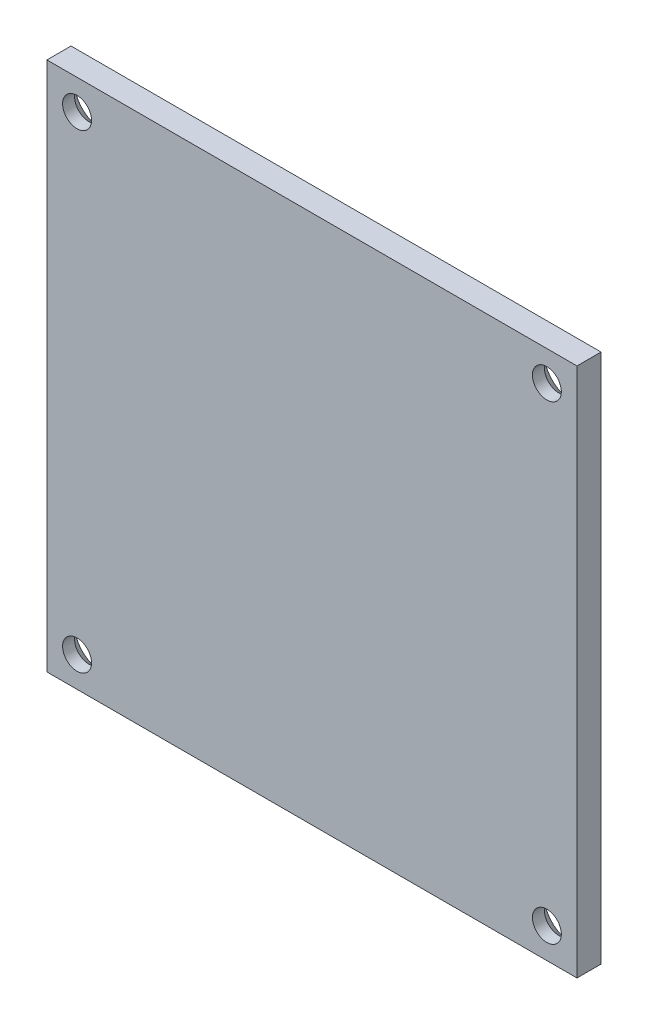
ISO-10303-21;
HEADER;
FILE_DESCRIPTION(('STEP AP214'),'2;1');
FILE_NAME('part.step','',(''),(''),'','','');
FILE_SCHEMA(('AUTOMOTIVE_DESIGN { 1 0 10303 214 1 1 1 1 }'));
ENDSEC;
DATA;
#1=APPLICATION_CONTEXT('core data for automotive mechanical design processes');
#2=APPLICATION_PROTOCOL_DEFINITION('international standard','automotive_design',2000,#1);
#3=PRODUCT_CONTEXT('',#1,'mechanical');
#4=PRODUCT('Part','Part','',(#3));
#5=PRODUCT_RELATED_PRODUCT_CATEGORY('part','',(#4));
#6=PRODUCT_DEFINITION_FORMATION('','',#4);
#7=PRODUCT_DEFINITION_CONTEXT('part definition',#1,'design');
#8=PRODUCT_DEFINITION('design','',#6,#7);
#9=PRODUCT_DEFINITION_SHAPE('','',#8);
#10=(LENGTH_UNIT() NAMED_UNIT(*) SI_UNIT(.MILLI.,.METRE.));
#11=(NAMED_UNIT(*) PLANE_ANGLE_UNIT() SI_UNIT($,.RADIAN.));
#12=(NAMED_UNIT(*) SI_UNIT($,.STERADIAN.) SOLID_ANGLE_UNIT());
#13=UNCERTAINTY_MEASURE_WITH_UNIT(LENGTH_MEASURE(1.E-05),#10,'distance_accuracy_value','');
#14=(GEOMETRIC_REPRESENTATION_CONTEXT(3) GLOBAL_UNCERTAINTY_ASSIGNED_CONTEXT((#13)) GLOBAL_UNIT_ASSIGNED_CONTEXT((#10,
#11,#12)) REPRESENTATION_CONTEXT('',''));
#15=CARTESIAN_POINT('',(0.,0.,0.));
#16=DIRECTION('',(0.,0.,1.));
#17=DIRECTION('',(1.,0.,0.));
#18=AXIS2_PLACEMENT_3D('',#15,#16,#17);
#19=CARTESIAN_POINT('',(22.,22.,2.));
#20=DIRECTION('',(0.,-1.,0.));
#21=DIRECTION('',(0.,0.,-1.));
#22=AXIS2_PLACEMENT_3D('',#19,#20,#21);
#23=PLANE('',#22);
#24=DIRECTION('',(-1.,0.,0.));
#25=VECTOR('',#24,1.);
#26=CARTESIAN_POINT('',(22.,22.,0.));
#27=LINE('',#26,#25);
#28=CARTESIAN_POINT('',(22.,22.,0.));
#29=VERTEX_POINT('',#28);
#30=CARTESIAN_POINT('',(-22.,22.,0.));
#31=VERTEX_POINT('',#30);
#32=EDGE_CURVE('E102',#29,#31,#27,.T.);
#33=ORIENTED_EDGE('',*,*,#32,.T.);
#34=DIRECTION('',(0.,0.,-1.));
#35=VECTOR('',#34,1.);
#36=CARTESIAN_POINT('',(-22.,22.,2.));
#37=LINE('',#36,#35);
#38=CARTESIAN_POINT('',(-22.,22.,2.));
#39=VERTEX_POINT('',#38);
#40=EDGE_CURVE('E11',#39,#31,#37,.T.);
#41=ORIENTED_EDGE('',*,*,#40,.F.);
#42=DIRECTION('',(-1.,0.,0.));
#43=VECTOR('',#42,1.);
#44=CARTESIAN_POINT('',(22.,22.,2.));
#45=LINE('',#44,#43);
#46=CARTESIAN_POINT('',(22.,22.,2.));
#47=VERTEX_POINT('',#46);
#48=EDGE_CURVE('E90',#47,#39,#45,.T.);
#49=ORIENTED_EDGE('',*,*,#48,.F.);
#50=DIRECTION('',(0.,0.,-1.));
#51=VECTOR('',#50,1.);
#52=CARTESIAN_POINT('',(22.,22.,2.));
#53=LINE('',#52,#51);
#54=EDGE_CURVE('E98',#47,#29,#53,.T.);
#55=ORIENTED_EDGE('',*,*,#54,.T.);
#56=EDGE_LOOP('',(#33,#41,#49,#55));
#57=FACE_BOUND('',#56,.T.);
#58=ADVANCED_FACE('F39',(#57),#23,.F.);
#59=CARTESIAN_POINT('',(-22.,-22.,2.));
#60=DIRECTION('',(1.,0.,0.));
#61=DIRECTION('',(0.,0.,-1.));
#62=AXIS2_PLACEMENT_3D('',#59,#60,#61);
#63=PLANE('',#62);
#64=DIRECTION('',(0.,-1.,0.));
#65=VECTOR('',#64,1.);
#66=CARTESIAN_POINT('',(-22.,-22.,0.));
#67=LINE('',#66,#65);
#68=CARTESIAN_POINT('',(-22.,-22.,0.));
#69=VERTEX_POINT('',#68);
#70=EDGE_CURVE('E94',#31,#69,#67,.T.);
#71=ORIENTED_EDGE('',*,*,#70,.T.);
#72=DIRECTION('',(0.,0.,-1.));
#73=VECTOR('',#72,1.);
#74=CARTESIAN_POINT('',(-22.,-22.,2.));
#75=LINE('',#74,#73);
#76=CARTESIAN_POINT('',(-22.,-22.,2.));
#77=VERTEX_POINT('',#76);
#78=EDGE_CURVE('E47',#77,#69,#75,.T.);
#79=ORIENTED_EDGE('',*,*,#78,.F.);
#80=DIRECTION('',(0.,-1.,0.));
#81=VECTOR('',#80,1.);
#82=CARTESIAN_POINT('',(-22.,-22.,2.));
#83=LINE('',#82,#81);
#84=EDGE_CURVE('E85',#39,#77,#83,.T.);
#85=ORIENTED_EDGE('',*,*,#84,.F.);
#86=ORIENTED_EDGE('',*,*,#40,.T.);
#87=EDGE_LOOP('',(#71,#79,#85,#86));
#88=FACE_BOUND('',#87,.T.);
#89=ADVANCED_FACE('F93',(#88),#63,.F.);
#90=CARTESIAN_POINT('',(22.,-22.,2.));
#91=DIRECTION('',(0.,1.,0.));
#92=DIRECTION('',(0.,0.,1.));
#93=AXIS2_PLACEMENT_3D('',#90,#91,#92);
#94=PLANE('',#93);
#95=DIRECTION('',(1.,0.,0.));
#96=VECTOR('',#95,1.);
#97=CARTESIAN_POINT('',(22.,-22.,0.));
#98=LINE('',#97,#96);
#99=CARTESIAN_POINT('',(22.,-22.,0.));
#100=VERTEX_POINT('',#99);
#101=EDGE_CURVE('E72',#69,#100,#98,.T.);
#102=ORIENTED_EDGE('',*,*,#101,.T.);
#103=DIRECTION('',(0.,0.,-1.));
#104=VECTOR('',#103,1.);
#105=CARTESIAN_POINT('',(22.,-22.,2.));
#106=LINE('',#105,#104);
#107=CARTESIAN_POINT('',(22.,-22.,2.));
#108=VERTEX_POINT('',#107);
#109=EDGE_CURVE('E95',#108,#100,#106,.T.);
#110=ORIENTED_EDGE('',*,*,#109,.F.);
#111=DIRECTION('',(1.,0.,0.));
#112=VECTOR('',#111,1.);
#113=CARTESIAN_POINT('',(22.,-22.,2.));
#114=LINE('',#113,#112);
#115=EDGE_CURVE('E88',#77,#108,#114,.T.);
#116=ORIENTED_EDGE('',*,*,#115,.F.);
#117=ORIENTED_EDGE('',*,*,#78,.T.);
#118=EDGE_LOOP('',(#102,#110,#116,#117));
#119=FACE_BOUND('',#118,.T.);
#120=ADVANCED_FACE('F96',(#119),#94,.F.);
#121=CARTESIAN_POINT('',(22.,-22.,2.));
#122=DIRECTION('',(-1.,0.,0.));
#123=DIRECTION('',(0.,0.,1.));
#124=AXIS2_PLACEMENT_3D('',#121,#122,#123);
#125=PLANE('',#124);
#126=DIRECTION('',(0.,1.,0.));
#127=VECTOR('',#126,1.);
#128=CARTESIAN_POINT('',(22.,-22.,0.));
#129=LINE('',#128,#127);
#130=EDGE_CURVE('E78',#100,#29,#129,.T.);
#131=ORIENTED_EDGE('',*,*,#130,.T.);
#132=ORIENTED_EDGE('',*,*,#54,.F.);
#133=DIRECTION('',(0.,1.,0.));
#134=VECTOR('',#133,1.);
#135=CARTESIAN_POINT('',(22.,-22.,2.));
#136=LINE('',#135,#134);
#137=EDGE_CURVE('E55',#108,#47,#136,.T.);
#138=ORIENTED_EDGE('',*,*,#137,.F.);
#139=ORIENTED_EDGE('',*,*,#109,.T.);
#140=EDGE_LOOP('',(#131,#132,#138,#139));
#141=FACE_BOUND('',#140,.T.);
#142=ADVANCED_FACE('F110',(#141),#125,.F.);
#143=CARTESIAN_POINT('',(0.,0.,2.));
#144=DIRECTION('',(0.,0.,-1.));
#145=DIRECTION('',(-1.,0.,0.));
#146=AXIS2_PLACEMENT_3D('',#143,#144,#145);
#147=PLANE('',#146);
#148=CARTESIAN_POINT('',(19.5,-19.5,2.));
#149=DIRECTION('',(0.,0.,-1.));
#150=DIRECTION('',(-1.,0.,0.));
#151=AXIS2_PLACEMENT_3D('',#148,#149,#150);
#152=CIRCLE('',#151,1.2);
#153=CARTESIAN_POINT('',(18.3,-19.5,2.));
#154=VERTEX_POINT('',#153);
#155=EDGE_CURVE('E142',#154,#154,#152,.T.);
#156=ORIENTED_EDGE('',*,*,#155,.T.);
#157=EDGE_LOOP('',(#156));
#158=FACE_BOUND('',#157,.T.);
#159=CARTESIAN_POINT('',(-19.5,-19.5,2.));
#160=DIRECTION('',(0.,0.,-1.));
#161=DIRECTION('',(-1.,0.,0.));
#162=AXIS2_PLACEMENT_3D('',#159,#160,#161);
#163=CIRCLE('',#162,1.2);
#164=CARTESIAN_POINT('',(-20.7,-19.5,2.));
#165=VERTEX_POINT('',#164);
#166=EDGE_CURVE('E133',#165,#165,#163,.T.);
#167=ORIENTED_EDGE('',*,*,#166,.T.);
#168=EDGE_LOOP('',(#167));
#169=FACE_BOUND('',#168,.T.);
#170=CARTESIAN_POINT('',(19.5,19.5,2.));
#171=DIRECTION('',(0.,0.,-1.));
#172=DIRECTION('',(-1.,0.,0.));
#173=AXIS2_PLACEMENT_3D('',#170,#171,#172);
#174=CIRCLE('',#173,1.2);
#175=CARTESIAN_POINT('',(18.3,19.5,2.));
#176=VERTEX_POINT('',#175);
#177=EDGE_CURVE('E124',#176,#176,#174,.T.);
#178=ORIENTED_EDGE('',*,*,#177,.T.);
#179=EDGE_LOOP('',(#178));
#180=FACE_BOUND('',#179,.T.);
#181=CARTESIAN_POINT('',(-19.5,19.5,2.));
#182=DIRECTION('',(0.,0.,-1.));
#183=DIRECTION('',(-1.,0.,0.));
#184=AXIS2_PLACEMENT_3D('',#181,#182,#183);
#185=CIRCLE('',#184,1.2);
#186=CARTESIAN_POINT('',(-20.7,19.5,2.));
#187=VERTEX_POINT('',#186);
#188=EDGE_CURVE('E105',#187,#187,#185,.T.);
#189=ORIENTED_EDGE('',*,*,#188,.T.);
#190=EDGE_LOOP('',(#189));
#191=FACE_BOUND('',#190,.T.);
#192=ORIENTED_EDGE('',*,*,#48,.T.);
#193=ORIENTED_EDGE('',*,*,#84,.T.);
#194=ORIENTED_EDGE('',*,*,#115,.T.);
#195=ORIENTED_EDGE('',*,*,#137,.T.);
#196=EDGE_LOOP('',(#192,#193,#194,#195));
#197=FACE_BOUND('',#196,.T.);
#198=ADVANCED_FACE('F86',(#158,#169,#180,#191,#197),#147,.F.);
#199=CARTESIAN_POINT('',(0.,0.,0.));
#200=DIRECTION('',(0.,0.,-1.));
#201=DIRECTION('',(-1.,0.,0.));
#202=AXIS2_PLACEMENT_3D('',#199,#200,#201);
#203=PLANE('',#202);
#204=CARTESIAN_POINT('',(19.5,-19.5,0.));
#205=DIRECTION('',(0.,0.,-1.));
#206=DIRECTION('',(-1.,0.,0.));
#207=AXIS2_PLACEMENT_3D('',#204,#205,#206);
#208=CIRCLE('',#207,2.2);
#209=CARTESIAN_POINT('',(17.3,-19.5,0.));
#210=VERTEX_POINT('',#209);
#211=EDGE_CURVE('E148',#210,#210,#208,.T.);
#212=ORIENTED_EDGE('',*,*,#211,.F.);
#213=EDGE_LOOP('',(#212));
#214=FACE_BOUND('',#213,.T.);
#215=CARTESIAN_POINT('',(-19.5,-19.5,0.));
#216=DIRECTION('',(0.,0.,-1.));
#217=DIRECTION('',(-1.,0.,0.));
#218=AXIS2_PLACEMENT_3D('',#215,#216,#217);
#219=CIRCLE('',#218,2.2);
#220=CARTESIAN_POINT('',(-21.7,-19.5,0.));
#221=VERTEX_POINT('',#220);
#222=EDGE_CURVE('E139',#221,#221,#219,.T.);
#223=ORIENTED_EDGE('',*,*,#222,.F.);
#224=EDGE_LOOP('',(#223));
#225=FACE_BOUND('',#224,.T.);
#226=CARTESIAN_POINT('',(19.5,19.5,0.));
#227=DIRECTION('',(0.,0.,-1.));
#228=DIRECTION('',(-1.,0.,0.));
#229=AXIS2_PLACEMENT_3D('',#226,#227,#228);
#230=CIRCLE('',#229,2.2);
#231=CARTESIAN_POINT('',(17.3,19.5,0.));
#232=VERTEX_POINT('',#231);
#233=EDGE_CURVE('E130',#232,#232,#230,.T.);
#234=ORIENTED_EDGE('',*,*,#233,.F.);
#235=EDGE_LOOP('',(#234));
#236=FACE_BOUND('',#235,.T.);
#237=CARTESIAN_POINT('',(-19.5,19.5,0.));
#238=DIRECTION('',(0.,0.,-1.));
#239=DIRECTION('',(-1.,0.,0.));
#240=AXIS2_PLACEMENT_3D('',#237,#238,#239);
#241=CIRCLE('',#240,2.2);
#242=CARTESIAN_POINT('',(-21.7,19.5,0.));
#243=VERTEX_POINT('',#242);
#244=EDGE_CURVE('E121',#243,#243,#241,.T.);
#245=ORIENTED_EDGE('',*,*,#244,.F.);
#246=EDGE_LOOP('',(#245));
#247=FACE_BOUND('',#246,.T.);
#248=ORIENTED_EDGE('',*,*,#32,.F.);
#249=ORIENTED_EDGE('',*,*,#130,.F.);
#250=ORIENTED_EDGE('',*,*,#101,.F.);
#251=ORIENTED_EDGE('',*,*,#70,.F.);
#252=EDGE_LOOP('',(#248,#249,#250,#251));
#253=FACE_BOUND('',#252,.T.);
#254=ADVANCED_FACE('F113',(#214,#225,#236,#247,#253),#203,.T.);
#255=CARTESIAN_POINT('',(-19.5,19.5,0.));
#256=DIRECTION('',(0.,0.,-1.));
#257=DIRECTION('',(-1.,0.,0.));
#258=AXIS2_PLACEMENT_3D('',#255,#256,#257);
#259=CYLINDRICAL_SURFACE('',#258,1.2);
#260=ORIENTED_EDGE('',*,*,#188,.F.);
#261=EDGE_LOOP('',(#260));
#262=FACE_BOUND('',#261,.T.);
#263=CARTESIAN_POINT('',(-19.5,19.5,1.));
#264=DIRECTION('',(0.,0.,-1.));
#265=DIRECTION('',(-1.,0.,0.));
#266=AXIS2_PLACEMENT_3D('',#263,#264,#265);
#267=CIRCLE('',#266,1.2);
#268=CARTESIAN_POINT('',(-20.7,19.5,1.));
#269=VERTEX_POINT('',#268);
#270=EDGE_CURVE('E118',#269,#269,#267,.T.);
#271=ORIENTED_EDGE('',*,*,#270,.T.);
#272=EDGE_LOOP('',(#271));
#273=FACE_BOUND('',#272,.T.);
#274=ADVANCED_FACE('F156',(#262,#273),#259,.F.);
#275=CARTESIAN_POINT('',(-19.5,19.5,0.));
#276=DIRECTION('',(0.,0.,-1.));
#277=DIRECTION('',(-1.,0.,0.));
#278=AXIS2_PLACEMENT_3D('',#275,#276,#277);
#279=CONICAL_SURFACE('',#278,2.2,0.785398163397447);
#280=ORIENTED_EDGE('',*,*,#270,.F.);
#281=EDGE_LOOP('',(#280));
#282=FACE_BOUND('',#281,.T.);
#283=ORIENTED_EDGE('',*,*,#244,.T.);
#284=EDGE_LOOP('',(#283));
#285=FACE_BOUND('',#284,.T.);
#286=ADVANCED_FACE('F164',(#282,#285),#279,.F.);
#287=CARTESIAN_POINT('',(19.5,19.5,0.));
#288=DIRECTION('',(0.,0.,-1.));
#289=DIRECTION('',(-1.,0.,0.));
#290=AXIS2_PLACEMENT_3D('',#287,#288,#289);
#291=CYLINDRICAL_SURFACE('',#290,1.2);
#292=ORIENTED_EDGE('',*,*,#177,.F.);
#293=EDGE_LOOP('',(#292));
#294=FACE_BOUND('',#293,.T.);
#295=CARTESIAN_POINT('',(19.5,19.5,1.));
#296=DIRECTION('',(0.,0.,-1.));
#297=DIRECTION('',(-1.,0.,0.));
#298=AXIS2_PLACEMENT_3D('',#295,#296,#297);
#299=CIRCLE('',#298,1.2);
#300=CARTESIAN_POINT('',(18.3,19.5,1.));
#301=VERTEX_POINT('',#300);
#302=EDGE_CURVE('E127',#301,#301,#299,.T.);
#303=ORIENTED_EDGE('',*,*,#302,.T.);
#304=EDGE_LOOP('',(#303));
#305=FACE_BOUND('',#304,.T.);
#306=ADVANCED_FACE('F166',(#294,#305),#291,.F.);
#307=CARTESIAN_POINT('',(19.5,19.5,0.));
#308=DIRECTION('',(0.,0.,-1.));
#309=DIRECTION('',(-1.,0.,0.));
#310=AXIS2_PLACEMENT_3D('',#307,#308,#309);
#311=CONICAL_SURFACE('',#310,2.2,0.785398163397447);
#312=ORIENTED_EDGE('',*,*,#302,.F.);
#313=EDGE_LOOP('',(#312));
#314=FACE_BOUND('',#313,.T.);
#315=ORIENTED_EDGE('',*,*,#233,.T.);
#316=EDGE_LOOP('',(#315));
#317=FACE_BOUND('',#316,.T.);
#318=ADVANCED_FACE('F173',(#314,#317),#311,.F.);
#319=CARTESIAN_POINT('',(-19.5,-19.5,0.));
#320=DIRECTION('',(0.,0.,-1.));
#321=DIRECTION('',(-1.,0.,0.));
#322=AXIS2_PLACEMENT_3D('',#319,#320,#321);
#323=CYLINDRICAL_SURFACE('',#322,1.2);
#324=ORIENTED_EDGE('',*,*,#166,.F.);
#325=EDGE_LOOP('',(#324));
#326=FACE_BOUND('',#325,.T.);
#327=CARTESIAN_POINT('',(-19.5,-19.5,1.));
#328=DIRECTION('',(0.,0.,-1.));
#329=DIRECTION('',(-1.,0.,0.));
#330=AXIS2_PLACEMENT_3D('',#327,#328,#329);
#331=CIRCLE('',#330,1.2);
#332=CARTESIAN_POINT('',(-20.7,-19.5,1.));
#333=VERTEX_POINT('',#332);
#334=EDGE_CURVE('E136',#333,#333,#331,.T.);
#335=ORIENTED_EDGE('',*,*,#334,.T.);
#336=EDGE_LOOP('',(#335));
#337=FACE_BOUND('',#336,.T.);
#338=ADVANCED_FACE('F207',(#326,#337),#323,.F.);
#339=CARTESIAN_POINT('',(-19.5,-19.5,0.));
#340=DIRECTION('',(0.,0.,-1.));
#341=DIRECTION('',(-1.,0.,0.));
#342=AXIS2_PLACEMENT_3D('',#339,#340,#341);
#343=CONICAL_SURFACE('',#342,2.2,0.785398163397447);
#344=ORIENTED_EDGE('',*,*,#334,.F.);
#345=EDGE_LOOP('',(#344));
#346=FACE_BOUND('',#345,.T.);
#347=ORIENTED_EDGE('',*,*,#222,.T.);
#348=EDGE_LOOP('',(#347));
#349=FACE_BOUND('',#348,.T.);
#350=ADVANCED_FACE('F212',(#346,#349),#343,.F.);
#351=CARTESIAN_POINT('',(19.5,-19.5,0.));
#352=DIRECTION('',(0.,0.,-1.));
#353=DIRECTION('',(-1.,0.,0.));
#354=AXIS2_PLACEMENT_3D('',#351,#352,#353);
#355=CYLINDRICAL_SURFACE('',#354,1.2);
#356=ORIENTED_EDGE('',*,*,#155,.F.);
#357=EDGE_LOOP('',(#356));
#358=FACE_BOUND('',#357,.T.);
#359=CARTESIAN_POINT('',(19.5,-19.5,1.));
#360=DIRECTION('',(0.,0.,-1.));
#361=DIRECTION('',(-1.,0.,0.));
#362=AXIS2_PLACEMENT_3D('',#359,#360,#361);
#363=CIRCLE('',#362,1.2);
#364=CARTESIAN_POINT('',(18.3,-19.5,1.));
#365=VERTEX_POINT('',#364);
#366=EDGE_CURVE('E145',#365,#365,#363,.T.);
#367=ORIENTED_EDGE('',*,*,#366,.T.);
#368=EDGE_LOOP('',(#367));
#369=FACE_BOUND('',#368,.T.);
#370=ADVANCED_FACE('F218',(#358,#369),#355,.F.);
#371=CARTESIAN_POINT('',(19.5,-19.5,0.));
#372=DIRECTION('',(0.,0.,-1.));
#373=DIRECTION('',(-1.,0.,0.));
#374=AXIS2_PLACEMENT_3D('',#371,#372,#373);
#375=CONICAL_SURFACE('',#374,2.2,0.785398163397447);
#376=ORIENTED_EDGE('',*,*,#366,.F.);
#377=EDGE_LOOP('',(#376));
#378=FACE_BOUND('',#377,.T.);
#379=ORIENTED_EDGE('',*,*,#211,.T.);
#380=EDGE_LOOP('',(#379));
#381=FACE_BOUND('',#380,.T.);
#382=ADVANCED_FACE('F152',(#378,#381),#375,.F.);
#383=CLOSED_SHELL('',(#58,#89,#120,#142,#198,#254,#274,#286,#306,#318,#338,#350,#370,#382));
#384=MANIFOLD_SOLID_BREP('B2',#383);
#385=ADVANCED_BREP_SHAPE_REPRESENTATION('',(#18,#384),#14);
#386=SHAPE_DEFINITION_REPRESENTATION(#9,#385);
ENDSEC;
END-ISO-10303-21;
